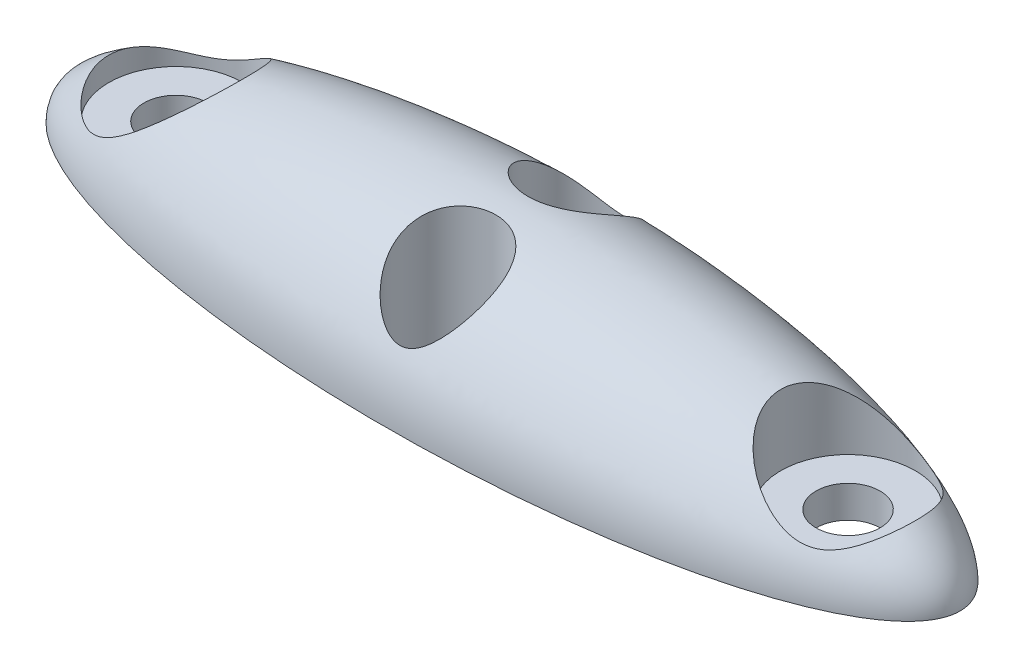
ISO-10303-21;
HEADER;
FILE_DESCRIPTION(('STEP AP214'),'2;1');
FILE_NAME('part.step','',(''),(''),'','','');
FILE_SCHEMA(('AUTOMOTIVE_DESIGN { 1 0 10303 214 1 1 1 1 }'));
ENDSEC;
DATA;
#1=APPLICATION_CONTEXT('core data for automotive mechanical design processes');
#2=APPLICATION_PROTOCOL_DEFINITION('international standard','automotive_design',2000,#1);
#3=PRODUCT_CONTEXT('',#1,'mechanical');
#4=PRODUCT('Part','Part','',(#3));
#5=PRODUCT_RELATED_PRODUCT_CATEGORY('part','',(#4));
#6=PRODUCT_DEFINITION_FORMATION('','',#4);
#7=PRODUCT_DEFINITION_CONTEXT('part definition',#1,'design');
#8=PRODUCT_DEFINITION('design','',#6,#7);
#9=PRODUCT_DEFINITION_SHAPE('','',#8);
#10=(LENGTH_UNIT() NAMED_UNIT(*) SI_UNIT(.MILLI.,.METRE.));
#11=(NAMED_UNIT(*) PLANE_ANGLE_UNIT() SI_UNIT($,.RADIAN.));
#12=(NAMED_UNIT(*) SI_UNIT($,.STERADIAN.) SOLID_ANGLE_UNIT());
#13=UNCERTAINTY_MEASURE_WITH_UNIT(LENGTH_MEASURE(1.E-05),#10,'distance_accuracy_value','');
#14=(GEOMETRIC_REPRESENTATION_CONTEXT(3) GLOBAL_UNCERTAINTY_ASSIGNED_CONTEXT((#13)) GLOBAL_UNIT_ASSIGNED_CONTEXT((#10,
#11,#12)) REPRESENTATION_CONTEXT('',''));
#15=CARTESIAN_POINT('',(0.,0.,0.));
#16=DIRECTION('',(0.,0.,1.));
#17=DIRECTION('',(1.,0.,0.));
#18=AXIS2_PLACEMENT_3D('',#15,#16,#17);
#19=CARTESIAN_POINT('',(0.,0.,0.));
#20=DIRECTION('',(0.,0.,1.));
#21=DIRECTION('',(1.,0.,0.));
#22=AXIS2_PLACEMENT_3D('',#19,#20,#21);
#23=ELLIPSE('',#22,14.,4.);
#24=TRIMMED_CURVE('',#23,(PARAMETER_VALUE(0.)),(PARAMETER_VALUE(3.14159265358979)),.T.,.PARAMETER.);
#25=CARTESIAN_POINT('',(-14.,0.,0.));
#26=DIRECTION('',(-1.,0.,0.));
#27=AXIS1_PLACEMENT('',#25,#26);
#28=SURFACE_OF_REVOLUTION('',#24,#27);
#29=CARTESIAN_POINT('',(0.,3.96862696659689,0.500000000000001));
#30=CARTESIAN_POINT('',(0.0829873456290196,3.96862794264542,0.500002232181164));
#31=CARTESIAN_POINT('',(0.166001678562705,3.96756092818171,0.506907439419062));
#32=CARTESIAN_POINT('',(0.329721125909353,3.96312366491739,0.534332869962188));
#33=CARTESIAN_POINT('',(0.410424953767484,3.959752157935,0.554860530528069));
#34=CARTESIAN_POINT('',(0.567205456777004,3.95021836810379,0.608902741009531));
#35=CARTESIAN_POINT('',(0.643281549609325,3.94405573486141,0.642418921406972));
#36=CARTESIAN_POINT('',(0.788581364081801,3.92822453148541,0.721339701729692));
#37=CARTESIAN_POINT('',(0.857806458226682,3.91855666539493,0.766741913778843));
#38=CARTESIAN_POINT('',(0.98699183338556,3.89498103571963,0.867519389768242));
#39=CARTESIAN_POINT('',(1.04701111211186,3.88110212967486,0.922825756835865));
#40=CARTESIAN_POINT('',(1.15671544006941,3.84836199177849,1.04159342102341));
#41=CARTESIAN_POINT('',(1.20640180708324,3.82950139595181,1.10505367658502));
#42=CARTESIAN_POINT('',(1.29408770089126,3.786444899749,1.23737206743756));
#43=CARTESIAN_POINT('',(1.33215296764778,3.76228039256654,1.30619696564411));
#44=CARTESIAN_POINT('',(1.39652704485301,3.70843748331479,1.44708518733529));
#45=CARTESIAN_POINT('',(1.42283480679283,3.67875858981841,1.51914879901098));
#46=CARTESIAN_POINT('',(1.46463437185147,3.61291772048715,1.66689181354298));
#47=CARTESIAN_POINT('',(1.47968364856836,3.57655438742683,1.7426054785331));
#48=CARTESIAN_POINT('',(1.4980809332986,3.49874583924889,1.89281517032452));
#49=CARTESIAN_POINT('',(1.50142307125354,3.45729808553656,1.9673105676493));
#50=CARTESIAN_POINT('',(1.49725898421767,3.36497531030218,2.12202144626306));
#51=CARTESIAN_POINT('',(1.48842984532143,3.31356488038698,2.20187841678502));
#52=CARTESIAN_POINT('',(1.45915952057029,3.2065966370895,2.35643774080756));
#53=CARTESIAN_POINT('',(1.43871701466399,3.15103835285859,2.43113950725116));
#54=CARTESIAN_POINT('',(1.38285651939546,3.0261151698727,2.58814094254037));
#55=CARTESIAN_POINT('',(1.34533338983669,2.95613041814707,2.66919389044095));
#56=CARTESIAN_POINT('',(1.25767928902446,2.81372412325307,2.82222326015292));
#57=CARTESIAN_POINT('',(1.20751333809449,2.74129631038407,2.8941736538359));
#58=CARTESIAN_POINT('',(1.11796149700208,2.62542863105844,3.00145098861311));
#59=CARTESIAN_POINT('',(1.08228209407273,2.58197410634335,3.0399209802886));
#60=CARTESIAN_POINT('',(1.00668469317716,2.49562892965721,3.11326683431258));
#61=CARTESIAN_POINT('',(0.966764146654849,2.45273863433285,3.14814051050459));
#62=CARTESIAN_POINT('',(0.882687457816609,2.36850893651482,3.21396211040882));
#63=CARTESIAN_POINT('',(0.838547546479954,2.3271643794118,3.24492409231488));
#64=CARTESIAN_POINT('',(0.745569537332512,2.2470342706361,3.30273621914028));
#65=CARTESIAN_POINT('',(0.696737838510997,2.20824535185467,3.32959183853481));
#66=CARTESIAN_POINT('',(0.603107387202033,2.14161282436697,3.37420391032067));
#67=CARTESIAN_POINT('',(0.559187249540424,2.1130608874217,3.39272708312477));
#68=CARTESIAN_POINT('',(0.467449082329615,2.06030673590107,3.42614110157792));
#69=CARTESIAN_POINT('',(0.419630730144661,2.03610488189272,3.44103164616442));
#70=CARTESIAN_POINT('',(0.319188828594917,1.99384352261183,3.46656972542908));
#71=CARTESIAN_POINT('',(0.26650251479837,1.97588456636059,3.47714823809402));
#72=CARTESIAN_POINT('',(0.185243384223565,1.95596571709625,3.48876984958451));
#73=CARTESIAN_POINT('',(0.157812490888768,1.95049790280268,3.49193503031451));
#74=CARTESIAN_POINT('',(0.102423720175209,1.94214415279299,3.49675650872969));
#75=CARTESIAN_POINT('',(0.0744659887040172,1.93925751264804,3.49841321809439));
#76=CARTESIAN_POINT('',(0.022257821492345,1.93644050156279,3.50002964603554));
#77=CARTESIAN_POINT('',(-0.0019676949905987,1.93615494911301,3.50019325591637));
#78=CARTESIAN_POINT('',(-0.0503396131113777,1.93762370385954,3.49935070048893));
#79=CARTESIAN_POINT('',(-0.0744859865099519,1.93937867335466,3.49834415537968));
#80=CARTESIAN_POINT('',(-0.146503636593642,1.94762337903653,3.49360056198619));
#81=CARTESIAN_POINT('',(-0.1939473971903,1.95709321366228,3.48813937918947));
#82=CARTESIAN_POINT('',(-0.295365249561802,1.98512321813309,3.47170232795383));
#83=CARTESIAN_POINT('',(-0.348783442497112,2.00510716649679,3.45985169742502));
#84=CARTESIAN_POINT('',(-0.451348832761957,2.05165391715642,3.43147816853956));
#85=CARTESIAN_POINT('',(-0.500485672933702,2.07823210569971,3.41494432995545));
#86=CARTESIAN_POINT('',(-0.587080002915757,2.1311280474643,3.38099302516661));
#87=CARTESIAN_POINT('',(-0.625153543593688,2.15681791543337,3.36413207654019));
#88=CARTESIAN_POINT('',(-0.698593517969923,2.21033539566176,3.32802202708726));
#89=CARTESIAN_POINT('',(-0.733958102679137,2.23816444250571,3.30877131821494));
#90=CARTESIAN_POINT('',(-0.80223843842594,2.29532664524265,3.26806786813662));
#91=CARTESIAN_POINT('',(-0.835149137365611,2.32466270501152,3.2466107892278));
#92=CARTESIAN_POINT('',(-0.898622353263348,2.38430764605774,3.20166133999503));
#93=CARTESIAN_POINT('',(-0.929184214509291,2.41461679566344,3.17816840519853));
#94=CARTESIAN_POINT('',(-1.00078229706668,2.48905112920771,3.11867802669067));
#95=CARTESIAN_POINT('',(-1.04064638422852,2.53349348645427,3.08165979292434));
#96=CARTESIAN_POINT('',(-1.11593660104198,2.62281300497147,3.00380174519893));
#97=CARTESIAN_POINT('',(-1.15136089061826,2.66769033827124,2.9629603589028));
#98=CARTESIAN_POINT('',(-1.21767104416901,2.75721764206924,2.87760686259349));
#99=CARTESIAN_POINT('',(-1.24856109028025,2.80186778494423,2.83309819500866));
#100=CARTESIAN_POINT('',(-1.3056163064352,2.89045728817364,2.74048937065931));
#101=CARTESIAN_POINT('',(-1.3317807240786,2.93439653432908,2.69238864369815));
#102=CARTESIAN_POINT('',(-1.39442187183558,3.04932288534252,2.56025256397624));
#103=CARTESIAN_POINT('',(-1.42653625536462,3.11931295558341,2.47319447804667));
#104=CARTESIAN_POINT('',(-1.47453834631579,3.25382023780748,2.29085148219101));
#105=CARTESIAN_POINT('',(-1.49045160297791,3.31834591933769,2.19557978337164));
#106=CARTESIAN_POINT('',(-1.50208546381382,3.42900001083932,2.01662871349426));
#107=CARTESIAN_POINT('',(-1.50090483234041,3.47635594967387,1.93391785909974));
#108=CARTESIAN_POINT('',(-1.48410981523822,3.56486344445984,1.76660332233087));
#109=CARTESIAN_POINT('',(-1.46850097650101,3.60601737768721,1.68200037956193));
#110=CARTESIAN_POINT('',(-1.42158178247379,3.68148820450181,1.51337433355248));
#111=CARTESIAN_POINT('',(-1.39017643751846,3.71576195958582,1.42935789372659));
#112=CARTESIAN_POINT('',(-1.3113864928045,3.77677784682433,1.26620439332527));
#113=CARTESIAN_POINT('',(-1.26400943070212,3.80352352085928,1.18706505186313));
#114=CARTESIAN_POINT('',(-1.16018733919737,3.84732008097207,1.04562999038227));
#115=CARTESIAN_POINT('',(-1.10526528453775,3.86510421367782,0.982438141103859));
#116=CARTESIAN_POINT('',(-0.984906566066583,3.89558676285903,0.865543820882988));
#117=CARTESIAN_POINT('',(-0.919470843897481,3.90828563443367,0.811840501016774));
#118=CARTESIAN_POINT('',(-0.782685993728831,3.92904064620381,0.717800857651199));
#119=CARTESIAN_POINT('',(-0.71165472927261,3.9372544214949,0.677035276259611));
#120=CARTESIAN_POINT('',(-0.563689421666436,3.9505256513401,0.607546284021789));
#121=CARTESIAN_POINT('',(-0.486758545391252,3.95558478615061,0.578816465247072));
#122=CARTESIAN_POINT('',(-0.341741086372073,3.96256558709047,0.53782499944735));
#123=CARTESIAN_POINT('',(-0.274200053188145,3.96485888386008,0.523668004037026));
#124=CARTESIAN_POINT('',(-0.137778911902844,3.96788919572799,0.504754412870709));
#125=CARTESIAN_POINT('',(-0.0688987569278036,3.96862615625008,0.499998146771581));
#126=CARTESIAN_POINT('',(0.,3.96862696659689,0.500000000000001));
#127=B_SPLINE_CURVE_WITH_KNOTS('',3,(#29,#30,#31,#32,#33,#34,#35,#36,#37,#38,#39,#40,#41,#42,
#43,#44,#45,#46,#47,#48,#49,#50,#51,#52,#53,#54,#55,#56,#57,#58,#59,#60,#61,#62,#63,#64,#65,#66,
#67,#68,#69,#70,#71,#72,#73,#74,#75,#76,#77,#78,#79,#80,#81,#82,#83,#84,#85,#86,#87,#88,#89,#90,
#91,#92,#93,#94,#95,#96,#97,#98,#99,#100,#101,#102,#103,#104,#105,#106,#107,#108,#109,#110,#111,
#112,#113,#114,#115,#116,#117,#118,#119,#120,#121,#122,#123,#124,#125,#126),.UNSPECIFIED.,.T.,
.F.,(4,2,2,2,2,2,2,2,2,2,2,2,2,2,2,2,2,2,2,2,2,2,2,2,2,2,2,2,2,2,2,2,2,2,2,2,2,2,2,2,2,2,2,2,2,
2,2,2,4),(0.,0.248716732770304,0.497569365778907,0.746453248014685,0.995287168375536,
1.24245297684092,1.48958724426383,1.7352964120399,1.98102748725883,2.23597218382259,
2.4910446935303,2.77613401957445,3.06125575722488,3.4004625942989,3.74061844172396,
3.94480517300818,4.14911530418859,4.35266891241481,4.55594873773084,4.72230406539562,
4.88867317546605,5.05760961409104,5.14191792249862,5.22620321527804,5.29877156623704,
5.37136347751712,5.51656516012596,5.69038504996384,5.86461438958558,6.01119723458553,
6.15787925386753,6.30485537172453,6.45187237217432,6.66234050929344,6.87289558855162,
7.08325522634299,7.2936483274921,7.6408935038866,7.98759022106717,8.27236793106914,
8.55703620444033,8.84343712266859,9.12970306627006,9.38518550367966,9.64064507189142,
9.88642852774771,10.1320809598693,10.3385663305779,10.5450589420131),.UNSPECIFIED.);
#128=CARTESIAN_POINT('',(0.,3.96862696659689,0.500000000000001));
#129=VERTEX_POINT('',#128);
#130=EDGE_CURVE('E70',#129,#129,#127,.T.);
#131=ORIENTED_EDGE('',*,*,#130,.T.);
#132=EDGE_LOOP('',(#131));
#133=FACE_BOUND('',#132,.T.);
#134=CARTESIAN_POINT('',(0.,1.93649167310371,-3.5));
#135=CARTESIAN_POINT('',(0.0466263362432785,1.93649810296024,-3.49999717245732));
#136=CARTESIAN_POINT('',(0.0933320785206388,1.94034628639147,-3.49779861924303));
#137=CARTESIAN_POINT('',(0.185249193693731,1.95516044623592,-3.48923880437414));
#138=CARTESIAN_POINT('',(0.23045559864408,1.96614799895064,-3.48286492374287));
#139=CARTESIAN_POINT('',(0.332321019513818,1.99825583452909,-3.46391034174196));
#140=CARTESIAN_POINT('',(0.388053132710736,2.02148674367454,-3.45000074998502));
#141=CARTESIAN_POINT('',(0.49464566398802,2.07460194177495,-3.4172004852664));
#142=CARTESIAN_POINT('',(0.545493859995044,2.10450233090375,-3.39829773809743));
#143=CARTESIAN_POINT('',(0.635281325372409,2.16368742888412,-3.35957004936892));
#144=CARTESIAN_POINT('',(0.674861842548205,2.19238922561095,-3.34031072553757));
#145=CARTESIAN_POINT('',(0.751021640345056,2.2518576540663,-3.29916958264156));
#146=CARTESIAN_POINT('',(0.787598838938244,2.28262569178275,-3.27728596974016));
#147=CARTESIAN_POINT('',(0.858029674631806,2.34555813346949,-3.23108138741802));
#148=CARTESIAN_POINT('',(0.891878311897822,2.37772494171362,-3.20675611907979));
#149=CARTESIAN_POINT('',(0.95695546715888,2.44290374603693,-3.15583010327925));
#150=CARTESIAN_POINT('',(0.988183352869565,2.47591594358237,-3.12922880980988));
#151=CARTESIAN_POINT('',(1.05805380929597,2.55342740260885,-3.0646484268212));
#152=CARTESIAN_POINT('',(1.09572015135945,2.59810488897777,-3.02582204896301));
#153=CARTESIAN_POINT('',(1.16661794302833,2.68758170466268,-2.94441305057903));
#154=CARTESIAN_POINT('',(1.19984787594975,2.73238107033209,-2.90182915368443));
#155=CARTESIAN_POINT('',(1.26168542643456,2.82148135168859,-2.81306262392394));
#156=CARTESIAN_POINT('',(1.29029872098977,2.86578281626426,-2.76688451604259));
#157=CARTESIAN_POINT('',(1.34265806640347,2.95344358345884,-2.67100927571417));
#158=CARTESIAN_POINT('',(1.36640355311389,2.99680277635445,-2.62131173628425));
#159=CARTESIAN_POINT('',(1.42130768602091,3.10776849876213,-2.4876429934348));
#160=CARTESIAN_POINT('',(1.44835452222591,3.1742991846368,-2.40101234377061));
#161=CARTESIAN_POINT('',(1.4865668796153,3.30171544553887,-2.22046688101724));
#162=CARTESIAN_POINT('',(1.49775535315135,3.3626090596482,-2.12656280319445));
#163=CARTESIAN_POINT('',(1.50131123109288,3.46731139621219,-1.94999168934427));
#164=CARTESIAN_POINT('',(1.49651446073824,3.5122740044748,-1.86807329627645));
#165=CARTESIAN_POINT('',(1.47267621262121,3.59597192807665,-1.7030831961898));
#166=CARTESIAN_POINT('',(1.45364020499852,3.63470962783374,-1.62001194407721));
#167=CARTESIAN_POINT('',(1.40028781332294,3.70543498171134,-1.45527457039224));
#168=CARTESIAN_POINT('',(1.36588830646995,3.73738450226786,-1.37361863714545));
#169=CARTESIAN_POINT('',(1.28181485212162,3.79405011082774,-1.21582544695931));
#170=CARTESIAN_POINT('',(1.23214622343486,3.81876871178976,-1.13968627971746));
#171=CARTESIAN_POINT('',(1.12429501531704,3.85931328254537,-1.00363304966509));
#172=CARTESIAN_POINT('',(1.06742928441067,3.87577454147862,-0.942859784540204));
#173=CARTESIAN_POINT('',(0.943746829683458,3.90386614866817,-0.831118957802017));
#174=CARTESIAN_POINT('',(0.876931787610734,3.91549731210684,-0.78014974232481));
#175=CARTESIAN_POINT('',(0.737443517594259,3.93448489991736,-0.691254130329678));
#176=CARTESIAN_POINT('',(0.665004934875912,3.94195865056169,-0.652983571986166));
#177=CARTESIAN_POINT('',(0.514655773123018,3.95390501119655,-0.588683486905518));
#178=CARTESIAN_POINT('',(0.436745140927497,3.95837759202624,-0.562654079110095));
#179=CARTESIAN_POINT('',(0.276939401950194,3.96492655943943,-0.523473088471327));
#180=CARTESIAN_POINT('',(0.1950156937813,3.96698191697411,-0.510434670306609));
#181=CARTESIAN_POINT('',(0.0301114508952437,3.96894104085422,-0.498024293904828));
#182=CARTESIAN_POINT('',(-0.0528691446697863,3.96884468275482,-0.498653126115386));
#183=CARTESIAN_POINT('',(-0.218143817354172,3.96647642469394,-0.513613234416758));
#184=CARTESIAN_POINT('',(-0.300429019855419,3.96418929720297,-0.528040418581394));
#185=CARTESIAN_POINT('',(-0.461371330341709,3.95706601520392,-0.570294503150055));
#186=CARTESIAN_POINT('',(-0.540028448853097,3.95222986809194,-0.59812136467424));
#187=CARTESIAN_POINT('',(-0.691279342578379,3.93939231194383,-0.666210314657225));
#188=CARTESIAN_POINT('',(-0.76388607592095,3.93139788959763,-0.706444912090365));
#189=CARTESIAN_POINT('',(-0.901117373050601,3.91145372129891,-0.79800634754388));
#190=CARTESIAN_POINT('',(-0.965743052270584,3.8995045289264,-0.849331632765309));
#191=CARTESIAN_POINT('',(-1.08457931143695,3.87100360513655,-0.960650349853458));
#192=CARTESIAN_POINT('',(-1.13889011574077,3.85450044348256,-1.02054926345723));
#193=CARTESIAN_POINT('',(-1.23656584297169,3.81624303313259,-1.14718192760142));
#194=CARTESIAN_POINT('',(-1.27993192063229,3.79448933887309,-1.21391495605697));
#195=CARTESIAN_POINT('',(-1.35501512774556,3.74541264020869,-1.35184166588645));
#196=CARTESIAN_POINT('',(-1.38671724977995,3.71808253067253,-1.42304095694015));
#197=CARTESIAN_POINT('',(-1.43829926806408,3.65795906207331,-1.56736423517611));
#198=CARTESIAN_POINT('',(-1.45817676395575,3.6251645954931,-1.64048860999984));
#199=CARTESIAN_POINT('',(-1.48740103675609,3.55250550803931,-1.79066182503922));
#200=CARTESIAN_POINT('',(-1.49607813623008,3.51234318178957,-1.86769509905899));
#201=CARTESIAN_POINT('',(-1.50179788366923,3.42714941581509,-2.01943605043388));
#202=CARTESIAN_POINT('',(-1.49883517742978,3.38211574458033,-2.09414264160708));
#203=CARTESIAN_POINT('',(-1.48137438281817,3.28146039106473,-2.2500335488659));
#204=CARTESIAN_POINT('',(-1.46531399753437,3.22524008080124,-2.3306531767581));
#205=CARTESIAN_POINT('',(-1.42148272620994,3.10900121211893,-2.48568295970446));
#206=CARTESIAN_POINT('',(-1.39370510604008,3.04898048641085,-2.56008951447599));
#207=CARTESIAN_POINT('',(-1.32122928626141,2.91402884001034,-2.71638369830191));
#208=CARTESIAN_POINT('',(-1.27424475827365,2.83853812132688,-2.79673923137262));
#209=CARTESIAN_POINT('',(-1.19387832165981,2.72446267649537,-2.90927576200212));
#210=CARTESIAN_POINT('',(-1.16540567068566,2.68625655018669,-2.94548938936176));
#211=CARTESIAN_POINT('',(-1.10521998270695,2.60991548020651,-3.0151888460003));
#212=CARTESIAN_POINT('',(-1.07350814829946,2.57178051543107,-3.04867567940505));
#213=CARTESIAN_POINT('',(-1.01086843518861,2.50058155588868,-3.10896319584382));
#214=CARTESIAN_POINT('',(-0.980309352550191,2.46746192279825,-3.13608275343414));
#215=CARTESIAN_POINT('',(-0.916611637090102,2.40196715359725,-3.18807101937698));
#216=CARTESIAN_POINT('',(-0.883474034230022,2.36959172684793,-3.21294061795313));
#217=CARTESIAN_POINT('',(-0.814523565094088,2.30610009047761,-3.26027675144424));
#218=CARTESIAN_POINT('',(-0.778715767953004,2.27498165946948,-3.28274765226628));
#219=CARTESIAN_POINT('',(-0.704169162669926,2.21460406944711,-3.32513506856024));
#220=CARTESIAN_POINT('',(-0.665432369125048,2.18534365749755,-3.34505331481796));
#221=CARTESIAN_POINT('',(-0.581604361670919,2.12741144017199,-3.38348319501768));
#222=CARTESIAN_POINT('',(-0.536253463592229,2.09895929921246,-3.40176767233951));
#223=CARTESIAN_POINT('',(-0.441478433341927,2.04691915431964,-3.4344340747109));
#224=CARTESIAN_POINT('',(-0.392057942223866,2.0233268670734,-3.44881943987057));
#225=CARTESIAN_POINT('',(-0.2982566387265,1.98684413137064,-3.47069279891102));
#226=CARTESIAN_POINT('',(-0.25451207229859,1.97280244502235,-3.47894798997195));
#227=CARTESIAN_POINT('',(-0.164964669932351,1.95114566081065,-3.49158047559456));
#228=CARTESIAN_POINT('',(-0.119169016070614,1.94350974198673,-3.49597033614384));
#229=CARTESIAN_POINT('',(-0.0608842244864671,1.93855946857259,-3.49881366243544));
#230=CARTESIAN_POINT('',(-0.0487266601473426,1.9377858165404,-3.49925775719491));
#231=CARTESIAN_POINT('',(-0.0243812101136561,1.93675104087875,-3.49985131707153));
#232=CARTESIAN_POINT('',(-0.0121933202759938,1.93648999162267,-3.50000073943476));
#233=CARTESIAN_POINT('',(0.,1.93649167310371,-3.5));
#234=B_SPLINE_CURVE_WITH_KNOTS('',3,(#134,#135,#136,#137,#138,#139,#140,#141,#142,#143,#144,
#145,#146,#147,#148,#149,#150,#151,#152,#153,#154,#155,#156,#157,#158,#159,#160,#161,#162,#163,
#164,#165,#166,#167,#168,#169,#170,#171,#172,#173,#174,#175,#176,#177,#178,#179,#180,#181,#182,
#183,#184,#185,#186,#187,#188,#189,#190,#191,#192,#193,#194,#195,#196,#197,#198,#199,#200,#201,
#202,#203,#204,#205,#206,#207,#208,#209,#210,#211,#212,#213,#214,#215,#216,#217,#218,#219,#220,
#221,#222,#223,#224,#225,#226,#227,#228,#229,#230,#231,#232,#233),.UNSPECIFIED.,.T.,.F.,(4,2,2,
2,2,2,2,2,2,2,2,2,2,2,2,2,2,2,2,2,2,2,2,2,2,2,2,2,2,2,2,2,2,2,2,2,2,2,2,2,2,2,2,2,2,2,2,2,2,4),
(0.,0.139824799099996,0.280074148701137,0.464901545534502,0.650180040891873,0.807611258308704,
0.965150708129435,1.1229725653929,1.28083239005885,1.49105236011792,1.70134401545893,
1.91137507520103,2.12143046246785,2.45763191064968,2.79334626433691,3.07289075694653,
3.35232791497238,3.63329560985663,3.91416554382708,4.16742619883118,4.42064409327034,
4.66629714286883,4.91195257931739,5.15972968958446,5.40752113011864,5.65704750484353,
5.90657315555943,6.1555498728061,6.40449175356806,6.65087487685224,6.89723199438001,
7.14390498768251,7.39062803767438,7.65150764863057,7.91250727587868,8.21017882083699,
8.50802167717597,8.86612350750345,9.04555651365139,9.22492314299259,9.38260303234705,
9.54022025836623,9.6975455272529,9.85476355349613,10.0241137801035,10.193314102346,
10.332839766478,10.4719101472124,10.5084706274446,10.5450364118342),.UNSPECIFIED.);
#235=CARTESIAN_POINT('',(0.,1.93649167310371,-3.5));
#236=VERTEX_POINT('',#235);
#237=EDGE_CURVE('E74',#236,#236,#234,.T.);
#238=ORIENTED_EDGE('',*,*,#237,.T.);
#239=EDGE_LOOP('',(#238));
#240=FACE_BOUND('',#239,.T.);
#241=CARTESIAN_POINT('',(-10.5,1.60934769394311,-2.1));
#242=CARTESIAN_POINT('',(-10.4209734122459,1.65143420426542,-2.10000131762377));
#243=CARTESIAN_POINT('',(-10.3434440073707,1.69639745496097,-2.0955506533599));
#244=CARTESIAN_POINT('',(-10.1913598551556,1.78981821811153,-2.07860705529194));
#245=CARTESIAN_POINT('',(-10.1168101155128,1.83828125799034,-2.06610114131829));
#246=CARTESIAN_POINT('',(-9.9702390854039,1.93737193467093,-2.03347456598901));
#247=CARTESIAN_POINT('',(-9.89823486498157,1.98801044720783,-2.0133103862909));
#248=CARTESIAN_POINT('',(-9.75728236048426,2.08994580493803,-1.96568019855641));
#249=CARTESIAN_POINT('',(-9.68833214900592,2.14124220778922,-1.93821887466169));
#250=CARTESIAN_POINT('',(-9.50384966054523,2.28128860333896,-1.85319269734035));
#251=CARTESIAN_POINT('',(-9.39139419718499,2.36980964779735,-1.78834943335908));
#252=CARTESIAN_POINT('',(-9.17804799775228,2.54126946025989,-1.63690809906218));
#253=CARTESIAN_POINT('',(-9.07711759067938,2.62422694514435,-1.55038814449628));
#254=CARTESIAN_POINT('',(-8.91173851584674,2.76192528082536,-1.37775167826839));
#255=CARTESIAN_POINT('',(-8.84426104589568,2.81874482278595,-1.29620793524524));
#256=CARTESIAN_POINT('',(-8.7203960034258,2.92377252538621,-1.12007409785245));
#257=CARTESIAN_POINT('',(-8.6639988354946,2.97198813358289,-1.02549541345599));
#258=CARTESIAN_POINT('',(-8.5740398918738,3.04924074394735,-0.84213324180284));
#259=CARTESIAN_POINT('',(-8.53820531513645,3.08016019413125,-0.7552662403171));
#260=CARTESIAN_POINT('',(-8.477982597523,3.13224440516493,-0.574862054009301));
#261=CARTESIAN_POINT('',(-8.45358655875996,3.15341589643704,-0.481329523044182));
#262=CARTESIAN_POINT('',(-8.41773500422139,3.18456055682782,-0.289393883857317));
#263=CARTESIAN_POINT('',(-8.40635313301124,3.19446999435238,-0.190966314314159));
#264=CARTESIAN_POINT('',(-8.39767888741019,3.20202019189904,0.00697522794760886));
#265=CARTESIAN_POINT('',(-8.40038261359837,3.1996643474107,0.106488892382527));
#266=CARTESIAN_POINT('',(-8.41873570469273,3.18369703721893,0.293897740398332));
#267=CARTESIAN_POINT('',(-8.43315543324997,3.1711547263428,0.382011563798604));
#268=CARTESIAN_POINT('',(-8.47247589693887,3.13703140760446,0.55401471590958));
#269=CARTESIAN_POINT('',(-8.49737770678136,3.11544947292536,0.637903610457433));
#270=CARTESIAN_POINT('',(-8.55782508813899,3.06323349557525,0.803829344657878));
#271=CARTESIAN_POINT('',(-8.59383623869343,3.0322044842708,0.885569295890076));
#272=CARTESIAN_POINT('',(-8.67440631180034,2.96310978518446,1.04160126414614));
#273=CARTESIAN_POINT('',(-8.71897666801134,2.92503468751805,1.11588311396859));
#274=CARTESIAN_POINT('',(-8.80274422162959,2.85391825405269,1.23827323190543));
#275=CARTESIAN_POINT('',(-8.84037173915895,2.8221036628096,1.28819723736775));
#276=CARTESIAN_POINT('',(-8.91894785418084,2.75603284049121,1.38350456211226));
#277=CARTESIAN_POINT('',(-8.95989365712104,2.72177866683991,1.42889163175704));
#278=CARTESIAN_POINT('',(-9.087247194751,2.61594150151342,1.55846640545728));
#279=CARTESIAN_POINT('',(-9.17808335655521,2.54135892327486,1.63594262709184));
#280=CARTESIAN_POINT('',(-9.37047946915258,2.38651034596648,1.7744035676839));
#281=CARTESIAN_POINT('',(-9.47220260800227,2.30616637481496,1.83506739491974));
#282=CARTESIAN_POINT('',(-9.68362943352589,2.144247987393,1.93839845790641));
#283=CARTESIAN_POINT('',(-9.79333497425821,2.06267328877361,1.98106149690082));
#284=CARTESIAN_POINT('',(-9.95958958358823,1.94511399084755,2.03002216434123));
#285=CARTESIAN_POINT('',(-10.0132997641207,1.90800768331128,2.04358172053704));
#286=CARTESIAN_POINT('',(-10.1223508849207,1.83493174396179,2.06651562606789));
#287=CARTESIAN_POINT('',(-10.1776911560524,1.79896165796824,2.07589166785951));
#288=CARTESIAN_POINT('',(-10.2900085972404,1.72881992264886,2.09024040538197));
#289=CARTESIAN_POINT('',(-10.3469843607261,1.69464679552613,2.0952167743518));
#290=CARTESIAN_POINT('',(-10.4626038773335,1.62892616784999,2.10046473860563));
#291=CARTESIAN_POINT('',(-10.5212467400815,1.59737729979757,2.10073879973694));
#292=CARTESIAN_POINT('',(-10.6573795081354,1.52939078707956,2.09549537066697));
#293=CARTESIAN_POINT('',(-10.7354436786617,1.49415271019503,2.08829133336176));
#294=CARTESIAN_POINT('',(-10.853994199151,1.44811551509979,2.07033406210167));
#295=CARTESIAN_POINT('',(-10.8937270569378,1.43391347395169,2.06316343128542));
#296=CARTESIAN_POINT('',(-10.9735099095893,1.40814918471928,2.04632559362616));
#297=CARTESIAN_POINT('',(-11.0135597215001,1.39658551445941,2.03665973781586));
#298=CARTESIAN_POINT('',(-11.094165425735,1.37631410519305,2.01462958903609));
#299=CARTESIAN_POINT('',(-11.1347218960432,1.36764032251293,2.00223587277453));
#300=CARTESIAN_POINT('',(-11.2155088195142,1.35356054578818,1.97480788042425));
#301=CARTESIAN_POINT('',(-11.2557392974718,1.34815430086942,1.95977380717055));
#302=CARTESIAN_POINT('',(-11.3354743741771,1.34065222387266,1.92713229554071));
#303=CARTESIAN_POINT('',(-11.3749787001983,1.33855761143784,1.90952391167716));
#304=CARTESIAN_POINT('',(-11.4528545616125,1.33751879409295,1.87188132543829));
#305=CARTESIAN_POINT('',(-11.4912259428332,1.3385750159741,1.85184679478578));
#306=CARTESIAN_POINT('',(-11.5702846954148,1.34374710704501,1.80741439405524));
#307=CARTESIAN_POINT('',(-11.6108197315259,1.34815849589994,1.78278052071496));
#308=CARTESIAN_POINT('',(-11.6898629605472,1.35979142511742,1.73102925729613));
#309=CARTESIAN_POINT('',(-11.7283696418467,1.36701502853506,1.70391005516081));
#310=CARTESIAN_POINT('',(-11.8407591611483,1.39195810494593,1.61900846877252));
#311=CARTESIAN_POINT('',(-11.9113541157072,1.41293486024175,1.55777127741802));
#312=CARTESIAN_POINT('',(-12.0205232280511,1.45091517137529,1.44973473438894));
#313=CARTESIAN_POINT('',(-12.0617853202022,1.46682014260002,1.40517049037538));
#314=CARTESIAN_POINT('',(-12.1402296174059,1.49925324334537,1.31275157201679));
#315=CARTESIAN_POINT('',(-12.1774108147228,1.5157815254385,1.26489608965811));
#316=CARTESIAN_POINT('',(-12.2475218437144,1.54852476985896,1.16611939467008));
#317=CARTESIAN_POINT('',(-12.280454351601,1.56473992389472,1.11520014181994));
#318=CARTESIAN_POINT('',(-12.3419357662032,1.59610282638224,1.01042678547276));
#319=CARTESIAN_POINT('',(-12.3704826700093,1.61125008542674,0.95657135614381));
#320=CARTESIAN_POINT('',(-12.422981407253,1.63982405970158,0.846101743234768));
#321=CARTESIAN_POINT('',(-12.4469253515469,1.65324780811135,0.789483028146517));
#322=CARTESIAN_POINT('',(-12.4898720929744,1.67775946941476,0.673946465806939));
#323=CARTESIAN_POINT('',(-12.5088780049872,1.68884885396815,0.61503009501276));
#324=CARTESIAN_POINT('',(-12.5416782411809,1.70821415204776,0.495372580425835));
#325=CARTESIAN_POINT('',(-12.5554778436637,1.71649291420378,0.434633352527247));
#326=CARTESIAN_POINT('',(-12.5776552732665,1.72988690088153,0.311832077653073));
#327=CARTESIAN_POINT('',(-12.5860340945654,1.73500270548646,0.249770275397372));
#328=CARTESIAN_POINT('',(-12.5964623460617,1.74138415262275,0.133366998522504));
#329=CARTESIAN_POINT('',(-12.5992117213289,1.74307522746053,0.0791103312854765));
#330=CARTESIAN_POINT('',(-12.6004951649014,1.74386381373383,-0.0294910821492246));
#331=CARTESIAN_POINT('',(-12.5990278819685,1.74296049378938,-0.0838358510023145));
#332=CARTESIAN_POINT('',(-12.5918966478564,1.73858812267192,-0.19211991894679));
#333=CARTESIAN_POINT('',(-12.5862347232754,1.73512031050859,-0.24605940114025));
#334=CARTESIAN_POINT('',(-12.5708028519786,1.72574235922895,-0.353138898051337));
#335=CARTESIAN_POINT('',(-12.5610313135067,1.71983127378724,-0.406278594722712));
#336=CARTESIAN_POINT('',(-12.5272853501419,1.69963384488084,-0.556959295468164));
#337=CARTESIAN_POINT('',(-12.4983415829939,1.68252904179946,-0.653062124292442));
#338=CARTESIAN_POINT('',(-12.427682085743,1.6423395516025,-0.839029756730497));
#339=CARTESIAN_POINT('',(-12.3859607319181,1.61925223212809,-0.928891792215082));
#340=CARTESIAN_POINT('',(-12.2856158082219,1.56692767275004,-1.11062804395449));
#341=CARTESIAN_POINT('',(-12.2256428579024,1.53729400345931,-1.20164776709639));
#342=CARTESIAN_POINT('',(-12.1256965750334,1.49313266816627,-1.33043947233908));
#343=CARTESIAN_POINT('',(-12.0906877101672,1.47844989655063,-1.37210774222008));
#344=CARTESIAN_POINT('',(-12.0173929775362,1.44991209877204,-1.45275233193063));
#345=CARTESIAN_POINT('',(-11.9791073635288,1.43605700865278,-1.49172885979186));
#346=CARTESIAN_POINT('',(-11.875155402858,1.40212093381479,-1.58954840528397));
#347=CARTESIAN_POINT('',(-11.8069059963234,1.38332721104376,-1.64618927394501));
#348=CARTESIAN_POINT('',(-11.6987994325602,1.36146467530663,-1.72477916896278));
#349=CARTESIAN_POINT('',(-11.6618431070227,1.35523451270557,-1.74989482843937));
#350=CARTESIAN_POINT('',(-11.5861545851853,1.34542149519424,-1.7978518339282));
#351=CARTESIAN_POINT('',(-11.5474235378886,1.34183695245546,-1.82069462190347));
#352=CARTESIAN_POINT('',(-11.474443927403,1.33810486701482,-1.86062285206911));
#353=CARTESIAN_POINT('',(-11.4404076652084,1.33751810545354,-1.87805584649113));
#354=CARTESIAN_POINT('',(-11.3714830723181,1.33881436140664,-1.9110142183121));
#355=CARTESIAN_POINT('',(-11.3365951356071,1.34069625739824,-1.92654045845485));
#356=CARTESIAN_POINT('',(-11.2662130141211,1.34704218684759,-1.9555989047031));
#357=CARTESIAN_POINT('',(-11.2307186367657,1.3515070559172,-1.96913046373532));
#358=CARTESIAN_POINT('',(-11.1594289129819,1.36299733785046,-1.99413710104801));
#359=CARTESIAN_POINT('',(-11.1236335581081,1.37002282280025,-2.0056121214195));
#360=CARTESIAN_POINT('',(-11.016507099062,1.39469851254764,-2.03684163251687));
#361=CARTESIAN_POINT('',(-10.9450889677904,1.41598055073299,-2.05354190738941));
#362=CARTESIAN_POINT('',(-10.8037040274116,1.4663154035419,-2.07917016403377));
#363=CARTESIAN_POINT('',(-10.7337377150047,1.49537083188171,-2.08809552727376));
#364=CARTESIAN_POINT('',(-10.6370138946536,1.54006945064786,-2.09571141022123));
#365=CARTESIAN_POINT('',(-10.6093503715588,1.55338893107564,-2.09733153220967));
#366=CARTESIAN_POINT('',(-10.5543993698054,1.58080911553577,-2.09947511372935));
#367=CARTESIAN_POINT('',(-10.5271115783923,1.59490911376028,-2.09999954796403));
#368=CARTESIAN_POINT('',(-10.5,1.60934769394311,-2.1));
#369=B_SPLINE_CURVE_WITH_KNOTS('',3,(#241,#242,#243,#244,#245,#246,#247,#248,#249,#250,#251,
#252,#253,#254,#255,#256,#257,#258,#259,#260,#261,#262,#263,#264,#265,#266,#267,#268,#269,#270,
#271,#272,#273,#274,#275,#276,#277,#278,#279,#280,#281,#282,#283,#284,#285,#286,#287,#288,#289,
#290,#291,#292,#293,#294,#295,#296,#297,#298,#299,#300,#301,#302,#303,#304,#305,#306,#307,#308,
#309,#310,#311,#312,#313,#314,#315,#316,#317,#318,#319,#320,#321,#322,#323,#324,#325,#326,#327,
#328,#329,#330,#331,#332,#333,#334,#335,#336,#337,#338,#339,#340,#341,#342,#343,#344,#345,#346,
#347,#348,#349,#350,#351,#352,#353,#354,#355,#356,#357,#358,#359,#360,#361,#362,#363,#364,#365,
#366,#367,#368),.UNSPECIFIED.,.T.,.F.,(4,2,2,2,2,2,2,2,2,2,2,2,2,2,2,2,2,2,2,2,2,2,2,2,2,2,2,2,
2,2,2,2,2,2,2,2,2,2,2,2,2,2,2,2,2,2,2,2,2,2,2,2,2,2,2,2,2,2,2,2,2,2,2,4),(0.,0.268554998493359,
0.537543830814705,0.808084642577288,1.07845220808125,1.54786523546352,2.0156103886229,
2.37472670912209,2.73353065486925,3.02909682375592,3.32445861352174,3.62148365094237,
3.91842646507802,4.18770265154609,4.45700645319287,4.73963185375287,5.02263745404392,
5.2328017180642,5.44279079206636,5.86327311238737,6.29130104421253,6.7194287126539,
6.91932977174217,7.11914988661361,7.31880301587502,7.51835144565678,7.77523057694287,
7.90350310332526,8.03170632204323,8.16136677861864,8.29101727889417,8.42071551711898,
8.55043132420828,8.69312404722196,8.8359216482102,9.122054649787,9.31022286265116,
9.49843743770076,9.68653287311728,9.87471395814579,10.0632147514279,10.2515963493348,
10.4397864441961,10.6279420149392,10.7907806447794,10.9536714624677,11.1164836324029,
11.2793589217133,11.5834115416423,11.8875981751965,12.2250477336122,12.3940172641632,
12.5629737212301,12.8338695745852,12.9690826531743,13.1042093950115,13.218819194977,
13.3333769451966,13.4479717764786,13.5625698340686,13.7906534810167,14.018813915157,
14.1110288979053,14.2031618129308),.UNSPECIFIED.);
#370=CARTESIAN_POINT('',(-10.5,1.60934769394311,-2.1));
#371=VERTEX_POINT('',#370);
#372=EDGE_CURVE('E40',#371,#371,#369,.T.);
#373=ORIENTED_EDGE('',*,*,#372,.T.);
#374=EDGE_LOOP('',(#373));
#375=FACE_BOUND('',#374,.T.);
#376=CARTESIAN_POINT('',(10.5,1.6093476939431,-2.1));
#377=CARTESIAN_POINT('',(10.5759866402752,1.5688736493634,-2.1000018736757));
#378=CARTESIAN_POINT('',(10.653415601625,1.53102214228506,-2.09589297861588));
#379=CARTESIAN_POINT('',(10.8107419364172,1.46338225103615,-2.07838035892866));
#380=CARTESIAN_POINT('',(10.8906348108524,1.43358003988579,-2.06499271616559));
#381=CARTESIAN_POINT('',(11.0117221552647,1.39709129839308,-2.03712828813162));
#382=CARTESIAN_POINT('',(11.052567665969,1.38625360481856,-2.0264456503405));
#383=CARTESIAN_POINT('',(11.1341982775671,1.36774876939079,-2.00239867474741));
#384=CARTESIAN_POINT('',(11.1749833833607,1.36008135455017,-1.98903456798948));
#385=CARTESIAN_POINT('',(11.2560569779074,1.34810601436227,-1.95965173081142));
#386=CARTESIAN_POINT('',(11.2963457981532,1.34379571180588,-1.94363488858692));
#387=CARTESIAN_POINT('',(11.3760251536078,1.33849232844775,-1.90904929255956));
#388=CARTESIAN_POINT('',(11.4154156992142,1.33749920922932,-1.89048056831294));
#389=CARTESIAN_POINT('',(11.5219010364477,1.33903409781747,-1.83615962802587));
#390=CARTESIAN_POINT('',(11.5877108157277,1.34474652566412,-1.79793279281379));
#391=CARTESIAN_POINT('',(11.7141290732008,1.36337392199556,-1.71511904670054));
#392=CARTESIAN_POINT('',(11.7747277493983,1.3763021354193,-1.67052055263142));
#393=CARTESIAN_POINT('',(11.8779985015791,1.40350434245106,-1.58574854950991));
#394=CARTESIAN_POINT('',(11.9217637931008,1.41692651724254,-1.54661062548948));
#395=CARTESIAN_POINT('',(12.0056158551899,1.44546167259047,-1.46510788656148));
#396=CARTESIAN_POINT('',(12.0457008464276,1.46057546324489,-1.42274152871544));
#397=CARTESIAN_POINT('',(12.1221452604123,1.49151842208934,-1.33492978025759));
#398=CARTESIAN_POINT('',(12.1585002858857,1.50734840364117,-1.28948085805854));
#399=CARTESIAN_POINT('',(12.2273513081483,1.53888221464721,-1.19567688008549));
#400=CARTESIAN_POINT('',(12.2598458055108,1.55458599289057,-1.14732070604747));
#401=CARTESIAN_POINT('',(12.3213969534077,1.58544420433244,-1.04692210946372));
#402=CARTESIAN_POINT('',(12.3503756460969,1.60058230784928,-0.99482674773867));
#403=CARTESIAN_POINT('',(12.403938839247,1.6293309497375,-0.888022886605616));
#404=CARTESIAN_POINT('',(12.4285239406667,1.64294169692697,-0.833314745874779));
#405=CARTESIAN_POINT('',(12.4730299598839,1.66806182692212,-0.721637718885636));
#406=CARTESIAN_POINT('',(12.4929563117957,1.67957365448759,-0.664671558124872));
#407=CARTESIAN_POINT('',(12.527912291889,1.70003618091955,-0.548842213966648));
#408=CARTESIAN_POINT('',(12.5429451641877,1.70898857607261,-0.489980315907056));
#409=CARTESIAN_POINT('',(12.5671045044965,1.72349285154309,-0.374604380484292));
#410=CARTESIAN_POINT('',(12.5765456764921,1.72922471553439,-0.318178938354421));
#411=CARTESIAN_POINT('',(12.5907967880986,1.73790934390751,-0.204560751881002));
#412=CARTESIAN_POINT('',(12.5956091015162,1.74086353274042,-0.147368416096663));
#413=CARTESIAN_POINT('',(12.6005291032824,1.74388368120898,-0.0326986993564792));
#414=CARTESIAN_POINT('',(12.6006365675413,1.74394950327306,0.0247786950461746));
#415=CARTESIAN_POINT('',(12.5961509038847,1.74119633270024,0.139461735154409));
#416=CARTESIAN_POINT('',(12.5915581218902,1.73837755235949,0.196667400546981));
#417=CARTESIAN_POINT('',(12.5724171974813,1.72670171165596,0.353986120472685));
#418=CARTESIAN_POINT('',(12.552933481783,1.71487054953356,0.453329514364308));
#419=CARTESIAN_POINT('',(12.5003717844189,1.68381610054256,0.646996075433936));
#420=CARTESIAN_POINT('',(12.467297935136,1.6645950608451,0.741320758823718));
#421=CARTESIAN_POINT('',(12.3865422140008,1.61968554142349,0.928393997271802));
#422=CARTESIAN_POINT('',(12.3381467001961,1.59369543439804,1.02075925213889));
#423=CARTESIAN_POINT('',(12.2285396996432,1.5390578500067,1.19706587098488));
#424=CARTESIAN_POINT('',(12.1672913019286,1.51040285452097,1.28098192047699));
#425=CARTESIAN_POINT('',(12.0611057141662,1.46656219632953,1.40590439964681));
#426=CARTESIAN_POINT('',(12.0201317634959,1.45077709112242,1.45012243915698));
#427=CARTESIAN_POINT('',(11.9341849412114,1.42087967837213,1.53517701116027));
#428=CARTESIAN_POINT('',(11.8892106132746,1.4067679844262,1.57601230164133));
#429=CARTESIAN_POINT('',(11.7955947241173,1.38154870263661,1.65382056904832));
#430=CARTESIAN_POINT('',(11.7469707179735,1.37042778194533,1.69081022107157));
#431=CARTESIAN_POINT('',(11.6461396211972,1.35253365928911,1.76071450363509));
#432=CARTESIAN_POINT('',(11.5939363469379,1.34575590386238,1.79363337273805));
#433=CARTESIAN_POINT('',(11.5067485087146,1.3393742587006,1.84335184875667));
#434=CARTESIAN_POINT('',(11.4726823818577,1.33803004414624,1.86155350433252));
#435=CARTESIAN_POINT('',(11.4035946566109,1.33780343750362,1.89605005057184));
#436=CARTESIAN_POINT('',(11.3685733630419,1.33892026889769,1.91234554096663));
#437=CARTESIAN_POINT('',(11.2978621384596,1.34376861700861,1.94290966730197));
#438=CARTESIAN_POINT('',(11.2621727213441,1.34749819850664,1.95717979399245));
#439=CARTESIAN_POINT('',(11.1904014680096,1.35758494621244,1.98363588613722));
#440=CARTESIAN_POINT('',(11.1543196103302,1.36394225682702,1.99582173699813));
#441=CARTESIAN_POINT('',(11.0461800116983,1.38677687746828,2.02912441073525));
#442=CARTESIAN_POINT('',(10.9739198852838,1.40703870679547,2.0471181637502));
#443=CARTESIAN_POINT('',(10.830640614019,1.45582385588529,2.07509999083191));
#444=CARTESIAN_POINT('',(10.7596239876685,1.48436225628952,2.08507332470132));
#445=CARTESIAN_POINT('',(10.6329502405289,1.54143342575778,2.09656064526587));
#446=CARTESIAN_POINT('',(10.5769293698934,1.56894557643416,2.09931817417972));
#447=CARTESIAN_POINT('',(10.4663471794911,1.62688658930994,2.10045886067729));
#448=CARTESIAN_POINT('',(10.4117867362103,1.6573171549461,2.09883944833025));
#449=CARTESIAN_POINT('',(10.3040384566807,1.72032650071688,2.09153579698532));
#450=CARTESIAN_POINT('',(10.2508542937783,1.75291034053562,2.08584165105011));
#451=CARTESIAN_POINT('',(10.1459497739363,1.81951796723231,2.07061773979));
#452=CARTESIAN_POINT('',(10.0942298329667,1.85354215658238,2.06108689597387));
#453=CARTESIAN_POINT('',(9.9732295164585,1.9353567452357,2.03412347924655));
#454=CARTESIAN_POINT('',(9.90458226655401,1.98355513615669,2.01507005588601));
#455=CARTESIAN_POINT('',(9.76998080863406,2.08064556734628,1.97030532913757));
#456=CARTESIAN_POINT('',(9.70402763294732,2.12953786401683,1.94459150078104));
#457=CARTESIAN_POINT('',(9.57499413636718,2.22712209932589,1.88662683490214));
#458=CARTESIAN_POINT('',(9.51191137562377,2.2758141748669,1.85438168110126));
#459=CARTESIAN_POINT('',(9.38880617527364,2.3722792626148,1.78333919865697));
#460=CARTESIAN_POINT('',(9.32878417254444,2.42005214301771,1.74454093804453));
#461=CARTESIAN_POINT('',(9.17628085300072,2.5428371785818,1.63440318263932));
#462=CARTESIAN_POINT('',(9.08651691139278,2.61654932908168,1.55771724391251));
#463=CARTESIAN_POINT('',(8.91849290534026,2.75618384748261,1.38677489373899));
#464=CARTESIAN_POINT('',(8.84021275490277,2.82211977596807,1.29254983081457));
#465=CARTESIAN_POINT('',(8.71465512865318,2.92869515034755,1.10991739162178));
#466=CARTESIAN_POINT('',(8.66436408829598,2.97168922657594,1.02496339740067));
#467=CARTESIAN_POINT('',(8.57503794038161,3.04837048705493,0.845304748509787));
#468=CARTESIAN_POINT('',(8.53599763960432,3.08206196498284,0.750604620034288));
#469=CARTESIAN_POINT('',(8.48755515029665,3.12397009285438,0.602344588694103));
#470=CARTESIAN_POINT('',(8.47304664642513,3.13654266451825,0.551616583709707));
#471=CARTESIAN_POINT('',(8.44778206601762,3.15845778779057,0.448564206279762));
#472=CARTESIAN_POINT('',(8.43702398901099,3.16780206134319,0.396240701118315));
#473=CARTESIAN_POINT('',(8.41949429422093,3.18303712729002,0.29046102800122));
#474=CARTESIAN_POINT('',(8.4127204390653,3.1889298579185,0.237005513242048));
#475=CARTESIAN_POINT('',(8.40329949948301,3.19712743917659,0.129478925326254));
#476=CARTESIAN_POINT('',(8.40065176930506,3.19943285123255,0.0754079498256622));
#477=CARTESIAN_POINT('',(8.39917540012442,3.20071743367121,-0.0715045235520985));
#478=CARTESIAN_POINT('',(8.40442122888127,3.19614826352375,-0.164473958154429));
#479=CARTESIAN_POINT('',(8.42692947975335,3.17657220462853,-0.347739947102502));
#480=CARTESIAN_POINT('',(8.44419165892768,3.16156552690139,-0.438036555447711));
#481=CARTESIAN_POINT('',(8.48912959192552,3.12260059647466,-0.61178608715852));
#482=CARTESIAN_POINT('',(8.51657591293449,3.09883964176696,-0.695343758397562));
#483=CARTESIAN_POINT('',(8.58051416797249,3.04368631125738,-0.856201979541578));
#484=CARTESIAN_POINT('',(8.6170101182053,3.01229054726508,-0.933499731049058));
#485=CARTESIAN_POINT('',(8.71422544256536,2.92905931476222,-1.11133671353262));
#486=CARTESIAN_POINT('',(8.77873482265504,2.87412735745285,-1.20836478233409));
#487=CARTESIAN_POINT('',(8.91945347769946,2.75548202569201,-1.38740864998807));
#488=CARTESIAN_POINT('',(8.99568622314985,2.69175106214813,-1.4693935935582));
#489=CARTESIAN_POINT('',(9.17981095060961,2.53992542268379,-1.63916287233384));
#490=CARTESIAN_POINT('',(9.29060269867894,2.44999325503156,-1.7221866519493));
#491=CARTESIAN_POINT('',(9.46523431132356,2.31219053494286,-1.82863838797041));
#492=CARTESIAN_POINT('',(9.52492374831402,2.26571856017298,-1.8611345215385));
#493=CARTESIAN_POINT('',(9.6469522554758,2.17241975159449,-1.92013016841365));
#494=CARTESIAN_POINT('',(9.70929079923652,2.12559298979211,-1.94663086653116));
#495=CARTESIAN_POINT('',(9.82955604042496,2.03737891678152,-1.99101886225986));
#496=CARTESIAN_POINT('',(9.88722662921849,1.99595316293054,-2.00952903226838));
#497=CARTESIAN_POINT('',(10.0045315819296,1.91398606736102,-2.04161897025971));
#498=CARTESIAN_POINT('',(10.0641656264997,1.87344458358562,-2.05519953574283));
#499=CARTESIAN_POINT('',(10.1853226513987,1.79404363657123,-2.07720075513091));
#500=CARTESIAN_POINT('',(10.2468418825692,1.75518116369986,-2.08563103069152));
#501=CARTESIAN_POINT('',(10.3718943917242,1.68003144388796,-2.09702816850893));
#502=CARTESIAN_POINT('',(10.4354264000713,1.64374261853404,-2.09999840774662));
#503=CARTESIAN_POINT('',(10.5,1.6093476939431,-2.1));
#504=B_SPLINE_CURVE_WITH_KNOTS('',3,(#376,#377,#378,#379,#380,#381,#382,#383,#384,#385,#386,
#387,#388,#389,#390,#391,#392,#393,#394,#395,#396,#397,#398,#399,#400,#401,#402,#403,#404,#405,
#406,#407,#408,#409,#410,#411,#412,#413,#414,#415,#416,#417,#418,#419,#420,#421,#422,#423,#424,
#425,#426,#427,#428,#429,#430,#431,#432,#433,#434,#435,#436,#437,#438,#439,#440,#441,#442,#443,
#444,#445,#446,#447,#448,#449,#450,#451,#452,#453,#454,#455,#456,#457,#458,#459,#460,#461,#462,
#463,#464,#465,#466,#467,#468,#469,#470,#471,#472,#473,#474,#475,#476,#477,#478,#479,#480,#481,
#482,#483,#484,#485,#486,#487,#488,#489,#490,#491,#492,#493,#494,#495,#496,#497,#498,#499,#500,
#501,#502,#503),.UNSPECIFIED.,.T.,.F.,(4,2,2,2,2,2,2,2,2,2,2,2,2,2,2,2,2,2,2,2,2,2,2,2,2,2,2,2,
2,2,2,2,2,2,2,2,2,2,2,2,2,2,2,2,2,2,2,2,2,2,2,2,2,2,2,2,2,2,2,2,2,2,2,4),(0.,0.25814915436591,
0.515852001546608,0.646446995828656,0.777030742452188,0.907521936967929,1.03801162024435,
1.26597628060321,1.49436076429154,1.67481583607195,1.8553576987599,2.03611001476816,
2.2169323069272,2.40122532251076,2.58549311102694,2.76954487926314,2.95347438126793,
3.12571222695772,3.29786169715334,3.47001936673934,3.64216436706426,3.94644494203674,
4.25063306210789,4.57183653484864,4.89397538374307,5.08072676178198,5.26754640642859,
5.45351885966457,5.63929601524902,5.75511672048558,5.87090088680858,5.98659938435021,
6.10230424094612,6.33271950029128,6.56355726298149,6.7507182755549,6.93798920400108,
7.1257169997311,7.31349760241202,7.57120787198844,7.82901598323653,8.08660069997527,
8.34422208076232,8.76014369363795,9.17532892626825,9.49718585051906,9.81889397024583,
9.9814029892268,10.1438251930966,10.3061561001583,10.4684615993795,10.7466069723729,
11.0247467221174,11.2969672845384,11.5693088746983,11.9536247256714,12.338720252164,
12.831226538006,13.0780328835203,13.3247904127865,13.544749618759,13.7646732243506,
13.9841847071116,14.2035603783556),.UNSPECIFIED.);
#505=CARTESIAN_POINT('',(10.5,1.6093476939431,-2.1));
#506=VERTEX_POINT('',#505);
#507=EDGE_CURVE('E80',#506,#506,#504,.T.);
#508=ORIENTED_EDGE('',*,*,#507,.T.);
#509=EDGE_LOOP('',(#508));
#510=FACE_BOUND('',#509,.T.);
#511=CARTESIAN_POINT('',(0.,0.,0.));
#512=DIRECTION('',(0.,-1.,0.));
#513=DIRECTION('',(1.,0.,0.));
#514=AXIS2_PLACEMENT_3D('',#511,#512,#513);
#515=ELLIPSE('',#514,14.,4.);
#516=CARTESIAN_POINT('',(-14.,0.,0.));
#517=VERTEX_POINT('',#516);
#518=CARTESIAN_POINT('',(14.,0.,0.));
#519=VERTEX_POINT('',#518);
#520=EDGE_CURVE('E49',#517,#519,#515,.F.);
#521=ORIENTED_EDGE('',*,*,#520,.T.);
#522=CARTESIAN_POINT('',(0.,0.,0.));
#523=DIRECTION('',(0.,1.,0.));
#524=DIRECTION('',(1.,0.,0.));
#525=AXIS2_PLACEMENT_3D('',#522,#523,#524);
#526=ELLIPSE('',#525,14.,4.);
#527=EDGE_CURVE('E11',#519,#517,#526,.T.);
#528=ORIENTED_EDGE('',*,*,#527,.T.);
#529=EDGE_LOOP('',(#521,#528));
#530=FACE_BOUND('',#529,.T.);
#531=ADVANCED_FACE('F35',(#133,#240,#375,#510,#530),#28,.T.);
#532=CARTESIAN_POINT('',(-26.9157785627443,0.,-4.));
#533=DIRECTION('',(0.,1.,0.));
#534=DIRECTION('',(0.,0.,1.));
#535=AXIS2_PLACEMENT_3D('',#532,#533,#534);
#536=PLANE('',#535);
#537=CARTESIAN_POINT('',(0.,0.,2.));
#538=DIRECTION('',(0.,-1.,0.));
#539=DIRECTION('',(0.,0.,-1.));
#540=AXIS2_PLACEMENT_3D('',#537,#538,#539);
#541=CIRCLE('',#540,1.5);
#542=CARTESIAN_POINT('',(0.,0.,0.5));
#543=VERTEX_POINT('',#542);
#544=EDGE_CURVE('E218',#543,#543,#541,.T.);
#545=ORIENTED_EDGE('',*,*,#544,.F.);
#546=EDGE_LOOP('',(#545));
#547=FACE_BOUND('',#546,.T.);
#548=CARTESIAN_POINT('',(0.,0.,-2.));
#549=DIRECTION('',(0.,-1.,0.));
#550=DIRECTION('',(0.,0.,-1.));
#551=AXIS2_PLACEMENT_3D('',#548,#549,#550);
#552=CIRCLE('',#551,1.5);
#553=CARTESIAN_POINT('',(0.,0.,-3.5));
#554=VERTEX_POINT('',#553);
#555=EDGE_CURVE('E217',#554,#554,#552,.T.);
#556=ORIENTED_EDGE('',*,*,#555,.F.);
#557=EDGE_LOOP('',(#556));
#558=FACE_BOUND('',#557,.T.);
#559=CARTESIAN_POINT('',(-10.5,0.,0.));
#560=DIRECTION('',(0.,-1.,0.));
#561=DIRECTION('',(0.,0.,-1.));
#562=AXIS2_PLACEMENT_3D('',#559,#560,#561);
#563=CIRCLE('',#562,1.);
#564=CARTESIAN_POINT('',(-10.5,0.,-1.));
#565=VERTEX_POINT('',#564);
#566=EDGE_CURVE('E58',#565,#565,#563,.T.);
#567=ORIENTED_EDGE('',*,*,#566,.F.);
#568=EDGE_LOOP('',(#567));
#569=FACE_BOUND('',#568,.T.);
#570=CARTESIAN_POINT('',(10.5,0.,0.));
#571=DIRECTION('',(0.,-1.,0.));
#572=DIRECTION('',(0.,0.,-1.));
#573=AXIS2_PLACEMENT_3D('',#570,#571,#572);
#574=CIRCLE('',#573,1.);
#575=CARTESIAN_POINT('',(10.5,0.,-1.));
#576=VERTEX_POINT('',#575);
#577=EDGE_CURVE('E83',#576,#576,#574,.T.);
#578=ORIENTED_EDGE('',*,*,#577,.F.);
#579=EDGE_LOOP('',(#578));
#580=FACE_BOUND('',#579,.T.);
#581=ORIENTED_EDGE('',*,*,#520,.F.);
#582=ORIENTED_EDGE('',*,*,#527,.F.);
#583=EDGE_LOOP('',(#581,#582));
#584=FACE_BOUND('',#583,.T.);
#585=ADVANCED_FACE('F56',(#547,#558,#569,#580,#584),#536,.F.);
#586=CARTESIAN_POINT('',(10.5,4.,0.));
#587=DIRECTION('',(0.,-1.,0.));
#588=DIRECTION('',(0.,0.,-1.));
#589=AXIS2_PLACEMENT_3D('',#586,#587,#588);
#590=CYLINDRICAL_SURFACE('',#589,1.);
#591=CARTESIAN_POINT('',(10.5,1.,0.));
#592=DIRECTION('',(0.,-1.,0.));
#593=DIRECTION('',(0.,0.,-1.));
#594=AXIS2_PLACEMENT_3D('',#591,#592,#593);
#595=CIRCLE('',#594,1.);
#596=CARTESIAN_POINT('',(10.5,1.,-1.));
#597=VERTEX_POINT('',#596);
#598=EDGE_CURVE('E82',#597,#597,#595,.F.);
#599=ORIENTED_EDGE('',*,*,#598,.T.);
#600=EDGE_LOOP('',(#599));
#601=FACE_BOUND('',#600,.T.);
#602=ORIENTED_EDGE('',*,*,#577,.T.);
#603=EDGE_LOOP('',(#602));
#604=FACE_BOUND('',#603,.T.);
#605=ADVANCED_FACE('F65',(#601,#604),#590,.F.);
#606=CARTESIAN_POINT('',(-10.5,4.,0.));
#607=DIRECTION('',(0.,-1.,0.));
#608=DIRECTION('',(0.,0.,-1.));
#609=AXIS2_PLACEMENT_3D('',#606,#607,#608);
#610=CYLINDRICAL_SURFACE('',#609,1.);
#611=CARTESIAN_POINT('',(-10.5,1.,0.));
#612=DIRECTION('',(0.,-1.,0.));
#613=DIRECTION('',(0.,0.,-1.));
#614=AXIS2_PLACEMENT_3D('',#611,#612,#613);
#615=CIRCLE('',#614,1.);
#616=CARTESIAN_POINT('',(-10.5,1.,-1.));
#617=VERTEX_POINT('',#616);
#618=EDGE_CURVE('E85',#617,#617,#615,.F.);
#619=ORIENTED_EDGE('',*,*,#618,.T.);
#620=EDGE_LOOP('',(#619));
#621=FACE_BOUND('',#620,.T.);
#622=ORIENTED_EDGE('',*,*,#566,.T.);
#623=EDGE_LOOP('',(#622));
#624=FACE_BOUND('',#623,.T.);
#625=ADVANCED_FACE('F100',(#621,#624),#610,.F.);
#626=CARTESIAN_POINT('',(-10.5,4.,0.));
#627=DIRECTION('',(0.,-1.,0.));
#628=DIRECTION('',(0.,0.,-1.));
#629=AXIS2_PLACEMENT_3D('',#626,#627,#628);
#630=CYLINDRICAL_SURFACE('',#629,2.1);
#631=CARTESIAN_POINT('',(-10.5,1.,0.));
#632=DIRECTION('',(0.,-1.,0.));
#633=DIRECTION('',(0.,0.,-1.));
#634=AXIS2_PLACEMENT_3D('',#631,#632,#633);
#635=CIRCLE('',#634,2.1);
#636=CARTESIAN_POINT('',(-10.5,1.,-2.1));
#637=VERTEX_POINT('',#636);
#638=EDGE_CURVE('E120',#637,#637,#635,.T.);
#639=ORIENTED_EDGE('',*,*,#638,.T.);
#640=EDGE_LOOP('',(#639));
#641=FACE_BOUND('',#640,.T.);
#642=ORIENTED_EDGE('',*,*,#372,.F.);
#643=EDGE_LOOP('',(#642));
#644=FACE_BOUND('',#643,.T.);
#645=ADVANCED_FACE('F103',(#641,#644),#630,.F.);
#646=CARTESIAN_POINT('',(-10.5,1.,0.));
#647=DIRECTION('',(0.,-1.,0.));
#648=DIRECTION('',(0.,0.,-1.));
#649=AXIS2_PLACEMENT_3D('',#646,#647,#648);
#650=PLANE('',#649);
#651=ORIENTED_EDGE('',*,*,#638,.F.);
#652=EDGE_LOOP('',(#651));
#653=FACE_BOUND('',#652,.T.);
#654=ORIENTED_EDGE('',*,*,#618,.F.);
#655=EDGE_LOOP('',(#654));
#656=FACE_BOUND('',#655,.T.);
#657=ADVANCED_FACE('F98',(#653,#656),#650,.F.);
#658=CARTESIAN_POINT('',(10.5,4.,0.));
#659=DIRECTION('',(0.,-1.,0.));
#660=DIRECTION('',(0.,0.,-1.));
#661=AXIS2_PLACEMENT_3D('',#658,#659,#660);
#662=CYLINDRICAL_SURFACE('',#661,2.1);
#663=CARTESIAN_POINT('',(10.5,1.,0.));
#664=DIRECTION('',(0.,-1.,0.));
#665=DIRECTION('',(0.,0.,-1.));
#666=AXIS2_PLACEMENT_3D('',#663,#664,#665);
#667=CIRCLE('',#666,2.1);
#668=CARTESIAN_POINT('',(10.5,1.,-2.1));
#669=VERTEX_POINT('',#668);
#670=EDGE_CURVE('E123',#669,#669,#667,.T.);
#671=ORIENTED_EDGE('',*,*,#670,.T.);
#672=EDGE_LOOP('',(#671));
#673=FACE_BOUND('',#672,.T.);
#674=ORIENTED_EDGE('',*,*,#507,.F.);
#675=EDGE_LOOP('',(#674));
#676=FACE_BOUND('',#675,.T.);
#677=ADVANCED_FACE('F92',(#673,#676),#662,.F.);
#678=CARTESIAN_POINT('',(10.5,1.,0.));
#679=DIRECTION('',(0.,-1.,0.));
#680=DIRECTION('',(0.,0.,-1.));
#681=AXIS2_PLACEMENT_3D('',#678,#679,#680);
#682=PLANE('',#681);
#683=ORIENTED_EDGE('',*,*,#670,.F.);
#684=EDGE_LOOP('',(#683));
#685=FACE_BOUND('',#684,.T.);
#686=ORIENTED_EDGE('',*,*,#598,.F.);
#687=EDGE_LOOP('',(#686));
#688=FACE_BOUND('',#687,.T.);
#689=ADVANCED_FACE('F97',(#685,#688),#682,.F.);
#690=CARTESIAN_POINT('',(0.,4.,-2.));
#691=DIRECTION('',(0.,-1.,0.));
#692=DIRECTION('',(0.,0.,-1.));
#693=AXIS2_PLACEMENT_3D('',#690,#691,#692);
#694=CYLINDRICAL_SURFACE('',#693,1.5);
#695=ORIENTED_EDGE('',*,*,#555,.T.);
#696=EDGE_LOOP('',(#695));
#697=FACE_BOUND('',#696,.T.);
#698=ORIENTED_EDGE('',*,*,#237,.F.);
#699=EDGE_LOOP('',(#698));
#700=FACE_BOUND('',#699,.T.);
#701=ADVANCED_FACE('F142',(#697,#700),#694,.F.);
#702=CARTESIAN_POINT('',(0.,4.,2.));
#703=DIRECTION('',(0.,-1.,0.));
#704=DIRECTION('',(0.,0.,-1.));
#705=AXIS2_PLACEMENT_3D('',#702,#703,#704);
#706=CYLINDRICAL_SURFACE('',#705,1.5);
#707=ORIENTED_EDGE('',*,*,#544,.T.);
#708=EDGE_LOOP('',(#707));
#709=FACE_BOUND('',#708,.T.);
#710=ORIENTED_EDGE('',*,*,#130,.F.);
#711=EDGE_LOOP('',(#710));
#712=FACE_BOUND('',#711,.T.);
#713=ADVANCED_FACE('F139',(#709,#712),#706,.F.);
#714=CLOSED_SHELL('',(#531,#585,#605,#625,#645,#657,#677,#689,#701,#713));
#715=MANIFOLD_SOLID_BREP('B2',#714);
#716=ADVANCED_BREP_SHAPE_REPRESENTATION('',(#18,#715),#14);
#717=SHAPE_DEFINITION_REPRESENTATION(#9,#716);
ENDSEC;
END-ISO-10303-21;
